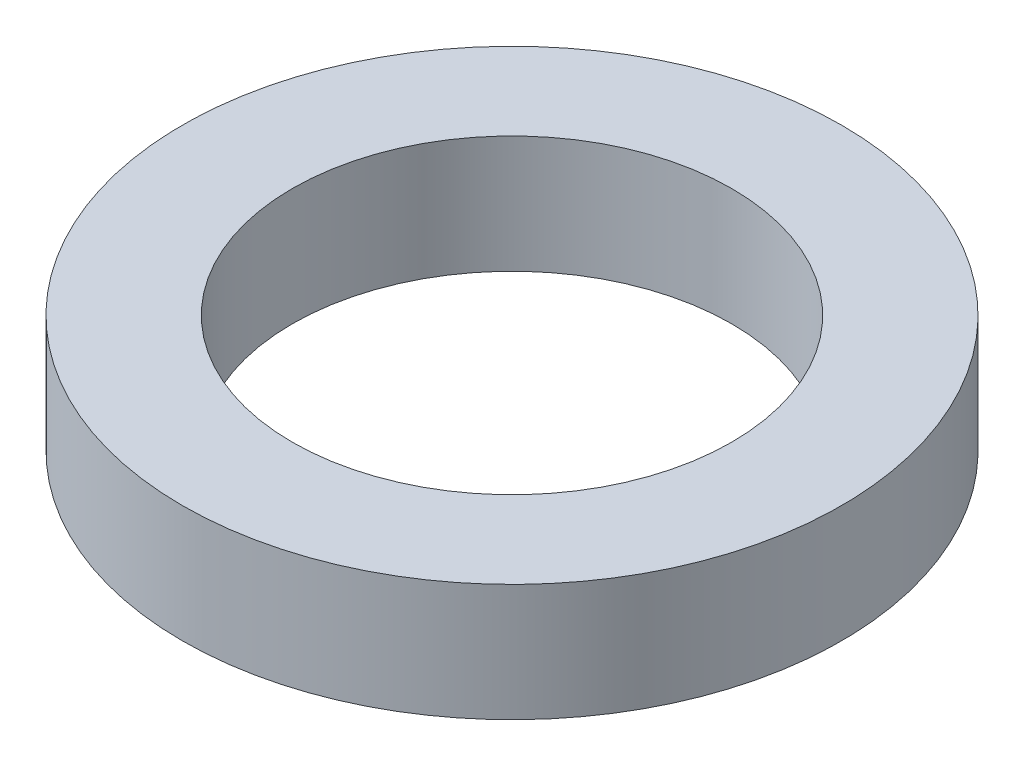
ISO-10303-21;
HEADER;
FILE_DESCRIPTION(('STEP AP214'),'2;1');
FILE_NAME('part.step','',(''),(''),'','','');
FILE_SCHEMA(('AUTOMOTIVE_DESIGN { 1 0 10303 214 1 1 1 1 }'));
ENDSEC;
DATA;
#1=APPLICATION_CONTEXT('core data for automotive mechanical design processes');
#2=APPLICATION_PROTOCOL_DEFINITION('international standard','automotive_design',2000,#1);
#3=PRODUCT_CONTEXT('',#1,'mechanical');
#4=PRODUCT('Part','Part','',(#3));
#5=PRODUCT_RELATED_PRODUCT_CATEGORY('part','',(#4));
#6=PRODUCT_DEFINITION_FORMATION('','',#4);
#7=PRODUCT_DEFINITION_CONTEXT('part definition',#1,'design');
#8=PRODUCT_DEFINITION('design','',#6,#7);
#9=PRODUCT_DEFINITION_SHAPE('','',#8);
#10=(LENGTH_UNIT() NAMED_UNIT(*) SI_UNIT(.MILLI.,.METRE.));
#11=(NAMED_UNIT(*) PLANE_ANGLE_UNIT() SI_UNIT($,.RADIAN.));
#12=(NAMED_UNIT(*) SI_UNIT($,.STERADIAN.) SOLID_ANGLE_UNIT());
#13=UNCERTAINTY_MEASURE_WITH_UNIT(LENGTH_MEASURE(1.E-05),#10,'distance_accuracy_value','');
#14=(GEOMETRIC_REPRESENTATION_CONTEXT(3) GLOBAL_UNCERTAINTY_ASSIGNED_CONTEXT((#13)) GLOBAL_UNIT_ASSIGNED_CONTEXT((#10,
#11,#12)) REPRESENTATION_CONTEXT('',''));
#15=CARTESIAN_POINT('',(0.,0.,0.));
#16=DIRECTION('',(0.,0.,1.));
#17=DIRECTION('',(1.,0.,0.));
#18=AXIS2_PLACEMENT_3D('',#15,#16,#17);
#19=CARTESIAN_POINT('',(0.,16.,0.));
#20=DIRECTION('',(0.,-1.,0.));
#21=DIRECTION('',(0.,0.,-1.));
#22=AXIS2_PLACEMENT_3D('',#19,#20,#21);
#23=CYLINDRICAL_SURFACE('',#22,45.);
#24=CARTESIAN_POINT('',(0.,16.,0.));
#25=DIRECTION('',(0.,1.,0.));
#26=DIRECTION('',(0.,0.,1.));
#27=AXIS2_PLACEMENT_3D('',#24,#25,#26);
#28=CIRCLE('',#27,45.);
#29=CARTESIAN_POINT('',(0.,16.,45.));
#30=VERTEX_POINT('',#29);
#31=EDGE_CURVE('E10',#30,#30,#28,.T.);
#32=ORIENTED_EDGE('',*,*,#31,.F.);
#33=EDGE_LOOP('',(#32));
#34=FACE_BOUND('',#33,.T.);
#35=CARTESIAN_POINT('',(0.,0.,0.));
#36=DIRECTION('',(0.,1.,0.));
#37=DIRECTION('',(0.,0.,1.));
#38=AXIS2_PLACEMENT_3D('',#35,#36,#37);
#39=CIRCLE('',#38,45.);
#40=CARTESIAN_POINT('',(0.,0.,45.));
#41=VERTEX_POINT('',#40);
#42=EDGE_CURVE('E37',#41,#41,#39,.T.);
#43=ORIENTED_EDGE('',*,*,#42,.T.);
#44=EDGE_LOOP('',(#43));
#45=FACE_BOUND('',#44,.T.);
#46=ADVANCED_FACE('F40',(#34,#45),#23,.T.);
#47=CARTESIAN_POINT('',(0.,16.,0.));
#48=DIRECTION('',(0.,1.,0.));
#49=DIRECTION('',(0.,0.,1.));
#50=AXIS2_PLACEMENT_3D('',#47,#48,#49);
#51=PLANE('',#50);
#52=CARTESIAN_POINT('',(0.,16.,0.));
#53=DIRECTION('',(0.,1.,0.));
#54=DIRECTION('',(0.,0.,1.));
#55=AXIS2_PLACEMENT_3D('',#52,#53,#54);
#56=CIRCLE('',#55,30.);
#57=CARTESIAN_POINT('',(0.,16.,30.));
#58=VERTEX_POINT('',#57);
#59=EDGE_CURVE('E50',#58,#58,#56,.T.);
#60=ORIENTED_EDGE('',*,*,#59,.F.);
#61=EDGE_LOOP('',(#60));
#62=FACE_BOUND('',#61,.T.);
#63=ORIENTED_EDGE('',*,*,#31,.T.);
#64=EDGE_LOOP('',(#63));
#65=FACE_BOUND('',#64,.T.);
#66=ADVANCED_FACE('F59',(#62,#65),#51,.T.);
#67=CARTESIAN_POINT('',(0.,0.,0.));
#68=DIRECTION('',(0.,1.,0.));
#69=DIRECTION('',(0.,0.,1.));
#70=AXIS2_PLACEMENT_3D('',#67,#68,#69);
#71=PLANE('',#70);
#72=CARTESIAN_POINT('',(0.,0.,0.));
#73=DIRECTION('',(0.,1.,0.));
#74=DIRECTION('',(0.,0.,1.));
#75=AXIS2_PLACEMENT_3D('',#72,#73,#74);
#76=CIRCLE('',#75,30.);
#77=CARTESIAN_POINT('',(0.,0.,30.));
#78=VERTEX_POINT('',#77);
#79=EDGE_CURVE('E47',#78,#78,#76,.T.);
#80=ORIENTED_EDGE('',*,*,#79,.T.);
#81=EDGE_LOOP('',(#80));
#82=FACE_BOUND('',#81,.T.);
#83=ORIENTED_EDGE('',*,*,#42,.F.);
#84=EDGE_LOOP('',(#83));
#85=FACE_BOUND('',#84,.T.);
#86=ADVANCED_FACE('F58',(#82,#85),#71,.F.);
#87=CARTESIAN_POINT('',(0.,16.,0.));
#88=DIRECTION('',(0.,-1.,0.));
#89=DIRECTION('',(0.,0.,-1.));
#90=AXIS2_PLACEMENT_3D('',#87,#88,#89);
#91=CYLINDRICAL_SURFACE('',#90,30.);
#92=ORIENTED_EDGE('',*,*,#59,.T.);
#93=EDGE_LOOP('',(#92));
#94=FACE_BOUND('',#93,.T.);
#95=ORIENTED_EDGE('',*,*,#79,.F.);
#96=EDGE_LOOP('',(#95));
#97=FACE_BOUND('',#96,.T.);
#98=ADVANCED_FACE('F54',(#94,#97),#91,.F.);
#99=CLOSED_SHELL('',(#46,#66,#86,#98));
#100=MANIFOLD_SOLID_BREP('B2',#99);
#101=ADVANCED_BREP_SHAPE_REPRESENTATION('',(#18,#100),#14);
#102=SHAPE_DEFINITION_REPRESENTATION(#9,#101);
ENDSEC;
END-ISO-10303-21;
